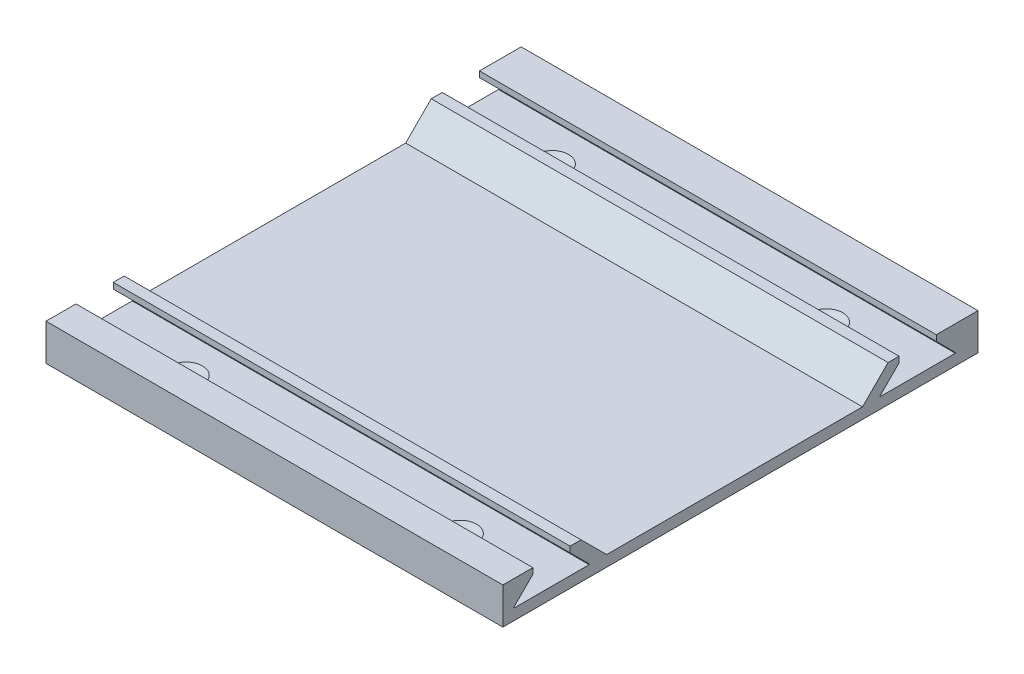
ISO-10303-21;
HEADER;
FILE_DESCRIPTION(('STEP AP214'),'2;1');
FILE_NAME('part.step','',(''),(''),'','','');
FILE_SCHEMA(('AUTOMOTIVE_DESIGN { 1 0 10303 214 1 1 1 1 }'));
ENDSEC;
DATA;
#1=APPLICATION_CONTEXT('core data for automotive mechanical design processes');
#2=APPLICATION_PROTOCOL_DEFINITION('international standard','automotive_design',2000,#1);
#3=PRODUCT_CONTEXT('',#1,'mechanical');
#4=PRODUCT('Part','Part','',(#3));
#5=PRODUCT_RELATED_PRODUCT_CATEGORY('part','',(#4));
#6=PRODUCT_DEFINITION_FORMATION('','',#4);
#7=PRODUCT_DEFINITION_CONTEXT('part definition',#1,'design');
#8=PRODUCT_DEFINITION('design','',#6,#7);
#9=PRODUCT_DEFINITION_SHAPE('','',#8);
#10=(LENGTH_UNIT() NAMED_UNIT(*) SI_UNIT(.MILLI.,.METRE.));
#11=(NAMED_UNIT(*) PLANE_ANGLE_UNIT() SI_UNIT($,.RADIAN.));
#12=(NAMED_UNIT(*) SI_UNIT($,.STERADIAN.) SOLID_ANGLE_UNIT());
#13=UNCERTAINTY_MEASURE_WITH_UNIT(LENGTH_MEASURE(1.E-05),#10,'distance_accuracy_value','');
#14=(GEOMETRIC_REPRESENTATION_CONTEXT(3) GLOBAL_UNCERTAINTY_ASSIGNED_CONTEXT((#13)) GLOBAL_UNIT_ASSIGNED_CONTEXT((#10,
#11,#12)) REPRESENTATION_CONTEXT('',''));
#15=CARTESIAN_POINT('',(0.,0.,0.));
#16=DIRECTION('',(0.,0.,1.));
#17=DIRECTION('',(1.,0.,0.));
#18=AXIS2_PLACEMENT_3D('',#15,#16,#17);
#19=CARTESIAN_POINT('',(0.,10.,0.));
#20=DIRECTION('',(0.,-1.,0.));
#21=DIRECTION('',(0.,0.,-1.));
#22=AXIS2_PLACEMENT_3D('',#19,#20,#21);
#23=PLANE('',#22);
#24=DIRECTION('',(-1.,0.,0.));
#25=VECTOR('',#24,1.);
#26=CARTESIAN_POINT('',(125.,10.,-21.4));
#27=LINE('',#26,#25);
#28=CARTESIAN_POINT('',(125.,10.,-21.4));
#29=VERTEX_POINT('',#28);
#30=CARTESIAN_POINT('',(0.,10.,-21.4));
#31=VERTEX_POINT('',#30);
#32=EDGE_CURVE('E230',#29,#31,#27,.T.);
#33=ORIENTED_EDGE('',*,*,#32,.T.);
#34=DIRECTION('',(0.,0.,1.));
#35=VECTOR('',#34,1.);
#36=CARTESIAN_POINT('',(0.,10.,0.));
#37=LINE('',#36,#35);
#38=CARTESIAN_POINT('',(0.,10.,-18.4));
#39=VERTEX_POINT('',#38);
#40=EDGE_CURVE('E353',#31,#39,#37,.T.);
#41=ORIENTED_EDGE('',*,*,#40,.T.);
#42=DIRECTION('',(1.,0.,0.));
#43=VECTOR('',#42,1.);
#44=CARTESIAN_POINT('',(-21.7568380055559,10.,-18.4));
#45=LINE('',#44,#43);
#46=CARTESIAN_POINT('',(125.,10.,-18.4));
#47=VERTEX_POINT('',#46);
#48=EDGE_CURVE('E249',#39,#47,#45,.T.);
#49=ORIENTED_EDGE('',*,*,#48,.T.);
#50=DIRECTION('',(0.,0.,-1.));
#51=VECTOR('',#50,1.);
#52=CARTESIAN_POINT('',(125.,10.,0.));
#53=LINE('',#52,#51);
#54=EDGE_CURVE('E360',#47,#29,#53,.T.);
#55=ORIENTED_EDGE('',*,*,#54,.T.);
#56=EDGE_LOOP('',(#33,#41,#49,#55));
#57=FACE_BOUND('',#56,.T.);
#58=ADVANCED_FACE('F35',(#57),#23,.F.);
#59=CARTESIAN_POINT('',(0.,10.,-108.4));
#60=VERTEX_POINT('',#59);
#61=CARTESIAN_POINT('',(0.,10.,-105.4));
#62=VERTEX_POINT('',#61);
#63=EDGE_CURVE('E352',#60,#62,#37,.T.);
#64=ORIENTED_EDGE('',*,*,#63,.T.);
#65=DIRECTION('',(-1.,0.,0.));
#66=VECTOR('',#65,1.);
#67=CARTESIAN_POINT('',(125.,10.,-105.4));
#68=LINE('',#67,#66);
#69=CARTESIAN_POINT('',(125.,10.,-105.4));
#70=VERTEX_POINT('',#69);
#71=EDGE_CURVE('E227',#70,#62,#68,.T.);
#72=ORIENTED_EDGE('',*,*,#71,.F.);
#73=CARTESIAN_POINT('',(125.,10.,-108.4));
#74=VERTEX_POINT('',#73);
#75=EDGE_CURVE('E217',#70,#74,#53,.T.);
#76=ORIENTED_EDGE('',*,*,#75,.T.);
#77=DIRECTION('',(1.,0.,0.));
#78=VECTOR('',#77,1.);
#79=CARTESIAN_POINT('',(-21.7568380055559,10.,-108.4));
#80=LINE('',#79,#78);
#81=EDGE_CURVE('E330',#60,#74,#80,.T.);
#82=ORIENTED_EDGE('',*,*,#81,.F.);
#83=EDGE_LOOP('',(#64,#72,#76,#82));
#84=FACE_BOUND('',#83,.T.);
#85=ADVANCED_FACE('F454',(#84),#23,.F.);
#86=CARTESIAN_POINT('',(0.,10.,-130.));
#87=VERTEX_POINT('',#86);
#88=CARTESIAN_POINT('',(0.,10.,-118.6));
#89=VERTEX_POINT('',#88);
#90=EDGE_CURVE('E348',#87,#89,#37,.T.);
#91=ORIENTED_EDGE('',*,*,#90,.T.);
#92=DIRECTION('',(1.,0.,0.));
#93=VECTOR('',#92,1.);
#94=CARTESIAN_POINT('',(-21.7568380055559,10.,-118.6));
#95=LINE('',#94,#93);
#96=CARTESIAN_POINT('',(125.,10.,-118.6));
#97=VERTEX_POINT('',#96);
#98=EDGE_CURVE('E301',#89,#97,#95,.T.);
#99=ORIENTED_EDGE('',*,*,#98,.T.);
#100=CARTESIAN_POINT('',(125.,10.,-130.));
#101=VERTEX_POINT('',#100);
#102=EDGE_CURVE('E355',#97,#101,#53,.T.);
#103=ORIENTED_EDGE('',*,*,#102,.T.);
#104=DIRECTION('',(-1.,0.,0.));
#105=VECTOR('',#104,1.);
#106=CARTESIAN_POINT('',(0.,10.,-130.));
#107=LINE('',#106,#105);
#108=EDGE_CURVE('E359',#101,#87,#107,.T.);
#109=ORIENTED_EDGE('',*,*,#108,.T.);
#110=EDGE_LOOP('',(#91,#99,#103,#109));
#111=FACE_BOUND('',#110,.T.);
#112=ADVANCED_FACE('F467',(#111),#23,.F.);
#113=CARTESIAN_POINT('',(0.,10.,0.));
#114=DIRECTION('',(1.,0.,0.));
#115=DIRECTION('',(0.,0.,-1.));
#116=AXIS2_PLACEMENT_3D('',#113,#114,#115);
#117=PLANE('',#116);
#118=DIRECTION('',(0.,0.,1.));
#119=VECTOR('',#118,1.);
#120=CARTESIAN_POINT('',(0.,3.,0.));
#121=LINE('',#120,#119);
#122=CARTESIAN_POINT('',(0.,3.,-98.4000000000001));
#123=VERTEX_POINT('',#122);
#124=CARTESIAN_POINT('',(0.,3.,-28.3999999999999));
#125=VERTEX_POINT('',#124);
#126=EDGE_CURVE('E221',#123,#125,#121,.T.);
#127=ORIENTED_EDGE('',*,*,#126,.F.);
#128=DIRECTION('',(0.,-0.707106781186552,0.707106781186543));
#129=VECTOR('',#128,1.);
#130=CARTESIAN_POINT('',(0.,-47.7000000000001,-47.7000000000007));
#131=LINE('',#130,#129);
#132=EDGE_CURVE('E204',#62,#123,#131,.T.);
#133=ORIENTED_EDGE('',*,*,#132,.F.);
#134=ORIENTED_EDGE('',*,*,#63,.F.);
#135=DIRECTION('',(0.,1.,0.));
#136=VECTOR('',#135,1.);
#137=CARTESIAN_POINT('',(0.,10.,-108.4));
#138=LINE('',#137,#136);
#139=CARTESIAN_POINT('',(0.,8.40000000000001,-108.4));
#140=VERTEX_POINT('',#139);
#141=EDGE_CURVE('E263',#140,#60,#138,.T.);
#142=ORIENTED_EDGE('',*,*,#141,.F.);
#143=DIRECTION('',(0.,0.707106781186547,-0.707106781186548));
#144=VECTOR('',#143,1.);
#145=CARTESIAN_POINT('',(0.,8.40000000000001,-108.4));
#146=LINE('',#145,#144);
#147=CARTESIAN_POINT('',(0.,3.20000000000001,-103.2));
#148=VERTEX_POINT('',#147);
#149=EDGE_CURVE('E298',#148,#140,#146,.T.);
#150=ORIENTED_EDGE('',*,*,#149,.F.);
#151=DIRECTION('',(0.,1.,0.));
#152=VECTOR('',#151,1.);
#153=CARTESIAN_POINT('',(0.,3.00000000000001,-103.2));
#154=LINE('',#153,#152);
#155=CARTESIAN_POINT('',(0.,3.00000000000001,-103.2));
#156=VERTEX_POINT('',#155);
#157=EDGE_CURVE('E300',#156,#148,#154,.T.);
#158=ORIENTED_EDGE('',*,*,#157,.F.);
#159=DIRECTION('',(0.,0.,1.));
#160=VECTOR('',#159,1.);
#161=CARTESIAN_POINT('',(0.,3.00000000000001,-123.8));
#162=LINE('',#161,#160);
#163=CARTESIAN_POINT('',(0.,3.00000000000001,-123.8));
#164=VERTEX_POINT('',#163);
#165=EDGE_CURVE('E303',#164,#156,#162,.T.);
#166=ORIENTED_EDGE('',*,*,#165,.F.);
#167=DIRECTION('',(0.,-1.,0.));
#168=VECTOR('',#167,1.);
#169=CARTESIAN_POINT('',(0.,3.00000000000001,-123.8));
#170=LINE('',#169,#168);
#171=CARTESIAN_POINT('',(0.,3.20000000000001,-123.8));
#172=VERTEX_POINT('',#171);
#173=EDGE_CURVE('E305',#172,#164,#170,.T.);
#174=ORIENTED_EDGE('',*,*,#173,.F.);
#175=DIRECTION('',(0.,-0.707106781186547,-0.707106781186548));
#176=VECTOR('',#175,1.);
#177=CARTESIAN_POINT('',(0.,8.40000000000001,-118.6));
#178=LINE('',#177,#176);
#179=CARTESIAN_POINT('',(0.,8.40000000000001,-118.6));
#180=VERTEX_POINT('',#179);
#181=EDGE_CURVE('E307',#180,#172,#178,.T.);
#182=ORIENTED_EDGE('',*,*,#181,.F.);
#183=DIRECTION('',(0.,-1.,0.));
#184=VECTOR('',#183,1.);
#185=CARTESIAN_POINT('',(0.,10.,-118.6));
#186=LINE('',#185,#184);
#187=EDGE_CURVE('E309',#89,#180,#186,.T.);
#188=ORIENTED_EDGE('',*,*,#187,.F.);
#189=ORIENTED_EDGE('',*,*,#90,.F.);
#190=DIRECTION('',(0.,-1.,0.));
#191=VECTOR('',#190,1.);
#192=CARTESIAN_POINT('',(0.,10.,-130.));
#193=LINE('',#192,#191);
#194=CARTESIAN_POINT('',(0.,0.,-130.));
#195=VERTEX_POINT('',#194);
#196=EDGE_CURVE('E362',#87,#195,#193,.T.);
#197=ORIENTED_EDGE('',*,*,#196,.T.);
#198=DIRECTION('',(0.,0.,1.));
#199=VECTOR('',#198,1.);
#200=CARTESIAN_POINT('',(0.,0.,0.));
#201=LINE('',#200,#199);
#202=CARTESIAN_POINT('',(0.,0.,0.));
#203=VERTEX_POINT('',#202);
#204=EDGE_CURVE('E297',#195,#203,#201,.T.);
#205=ORIENTED_EDGE('',*,*,#204,.T.);
#206=DIRECTION('',(0.,-1.,0.));
#207=VECTOR('',#206,1.);
#208=CARTESIAN_POINT('',(0.,10.,0.));
#209=LINE('',#208,#207);
#210=CARTESIAN_POINT('',(0.,10.,0.));
#211=VERTEX_POINT('',#210);
#212=EDGE_CURVE('E380',#211,#203,#209,.T.);
#213=ORIENTED_EDGE('',*,*,#212,.F.);
#214=CARTESIAN_POINT('',(0.,10.,-8.20000000000001));
#215=VERTEX_POINT('',#214);
#216=EDGE_CURVE('E371',#215,#211,#37,.T.);
#217=ORIENTED_EDGE('',*,*,#216,.F.);
#218=DIRECTION('',(0.,1.,0.));
#219=VECTOR('',#218,1.);
#220=CARTESIAN_POINT('',(0.,10.,-8.20000000000001));
#221=LINE('',#220,#219);
#222=CARTESIAN_POINT('',(0.,8.4,-8.20000000000002));
#223=VERTEX_POINT('',#222);
#224=EDGE_CURVE('E59',#223,#215,#221,.T.);
#225=ORIENTED_EDGE('',*,*,#224,.F.);
#226=DIRECTION('',(0.,0.707106781186546,-0.707106781186549));
#227=VECTOR('',#226,1.);
#228=CARTESIAN_POINT('',(0.,8.4,-8.20000000000002));
#229=LINE('',#228,#227);
#230=CARTESIAN_POINT('',(0.,3.2,-3.));
#231=VERTEX_POINT('',#230);
#232=EDGE_CURVE('E246',#231,#223,#229,.T.);
#233=ORIENTED_EDGE('',*,*,#232,.F.);
#234=DIRECTION('',(0.,1.,0.));
#235=VECTOR('',#234,1.);
#236=CARTESIAN_POINT('',(0.,3.,-3.));
#237=LINE('',#236,#235);
#238=CARTESIAN_POINT('',(0.,3.,-3.));
#239=VERTEX_POINT('',#238);
#240=EDGE_CURVE('E248',#239,#231,#237,.T.);
#241=ORIENTED_EDGE('',*,*,#240,.F.);
#242=DIRECTION('',(0.,0.,1.));
#243=VECTOR('',#242,1.);
#244=CARTESIAN_POINT('',(0.,3.,-3.));
#245=LINE('',#244,#243);
#246=CARTESIAN_POINT('',(0.,3.,-23.6));
#247=VERTEX_POINT('',#246);
#248=EDGE_CURVE('E251',#247,#239,#245,.T.);
#249=ORIENTED_EDGE('',*,*,#248,.F.);
#250=DIRECTION('',(0.,-1.,0.));
#251=VECTOR('',#250,1.);
#252=CARTESIAN_POINT('',(0.,3.,-23.6));
#253=LINE('',#252,#251);
#254=CARTESIAN_POINT('',(0.,3.2,-23.6));
#255=VERTEX_POINT('',#254);
#256=EDGE_CURVE('E253',#255,#247,#253,.T.);
#257=ORIENTED_EDGE('',*,*,#256,.F.);
#258=DIRECTION('',(0.,-0.707106781186547,-0.707106781186549));
#259=VECTOR('',#258,1.);
#260=CARTESIAN_POINT('',(0.,8.4,-18.4));
#261=LINE('',#260,#259);
#262=CARTESIAN_POINT('',(0.,8.4,-18.4));
#263=VERTEX_POINT('',#262);
#264=EDGE_CURVE('E255',#263,#255,#261,.T.);
#265=ORIENTED_EDGE('',*,*,#264,.F.);
#266=DIRECTION('',(0.,-1.,0.));
#267=VECTOR('',#266,1.);
#268=CARTESIAN_POINT('',(0.,10.,-18.4));
#269=LINE('',#268,#267);
#270=EDGE_CURVE('E257',#39,#263,#269,.T.);
#271=ORIENTED_EDGE('',*,*,#270,.F.);
#272=ORIENTED_EDGE('',*,*,#40,.F.);
#273=DIRECTION('',(0.,-0.707106781186551,-0.707106781186544));
#274=VECTOR('',#273,1.);
#275=CARTESIAN_POINT('',(0.,15.6999999999999,-15.7000000000001));
#276=LINE('',#275,#274);
#277=EDGE_CURVE('E218',#31,#125,#276,.T.);
#278=ORIENTED_EDGE('',*,*,#277,.T.);
#279=EDGE_LOOP('',(#127,#133,#134,#142,#150,#158,#166,#174,#182,#188,#189,#197,#205,#213,#217,
#225,#233,#241,#249,#257,#265,#271,#272,#278));
#280=FACE_BOUND('',#279,.T.);
#281=ADVANCED_FACE('F432',(#280),#117,.F.);
#282=CARTESIAN_POINT('',(0.,10.,0.));
#283=DIRECTION('',(0.,0.,-1.));
#284=DIRECTION('',(-1.,0.,0.));
#285=AXIS2_PLACEMENT_3D('',#282,#283,#284);
#286=PLANE('',#285);
#287=DIRECTION('',(1.,0.,0.));
#288=VECTOR('',#287,1.);
#289=CARTESIAN_POINT('',(0.,0.,0.));
#290=LINE('',#289,#288);
#291=CARTESIAN_POINT('',(125.,0.,0.));
#292=VERTEX_POINT('',#291);
#293=EDGE_CURVE('E365',#203,#292,#290,.T.);
#294=ORIENTED_EDGE('',*,*,#293,.T.);
#295=DIRECTION('',(0.,-1.,0.));
#296=VECTOR('',#295,1.);
#297=CARTESIAN_POINT('',(125.,10.,0.));
#298=LINE('',#297,#296);
#299=CARTESIAN_POINT('',(125.,10.,0.));
#300=VERTEX_POINT('',#299);
#301=EDGE_CURVE('E377',#300,#292,#298,.T.);
#302=ORIENTED_EDGE('',*,*,#301,.F.);
#303=DIRECTION('',(1.,0.,0.));
#304=VECTOR('',#303,1.);
#305=CARTESIAN_POINT('',(0.,10.,0.));
#306=LINE('',#305,#304);
#307=EDGE_CURVE('E351',#211,#300,#306,.T.);
#308=ORIENTED_EDGE('',*,*,#307,.F.);
#309=ORIENTED_EDGE('',*,*,#212,.T.);
#310=EDGE_LOOP('',(#294,#302,#308,#309));
#311=FACE_BOUND('',#310,.T.);
#312=ADVANCED_FACE('F448',(#311),#286,.F.);
#313=CARTESIAN_POINT('',(125.,10.,0.));
#314=DIRECTION('',(-1.,0.,0.));
#315=DIRECTION('',(0.,0.,1.));
#316=AXIS2_PLACEMENT_3D('',#313,#314,#315);
#317=PLANE('',#316);
#318=ORIENTED_EDGE('',*,*,#75,.F.);
#319=DIRECTION('',(0.,-0.707106781186552,0.707106781186543));
#320=VECTOR('',#319,1.);
#321=CARTESIAN_POINT('',(125.,-47.7000000000001,-47.7000000000007));
#322=LINE('',#321,#320);
#323=CARTESIAN_POINT('',(125.,3.,-98.4000000000001));
#324=VERTEX_POINT('',#323);
#325=EDGE_CURVE('E201',#70,#324,#322,.T.);
#326=ORIENTED_EDGE('',*,*,#325,.T.);
#327=DIRECTION('',(0.,0.,1.));
#328=VECTOR('',#327,1.);
#329=CARTESIAN_POINT('',(125.,3.,0.));
#330=LINE('',#329,#328);
#331=CARTESIAN_POINT('',(125.,3.,-28.3999999999999));
#332=VERTEX_POINT('',#331);
#333=EDGE_CURVE('E209',#324,#332,#330,.T.);
#334=ORIENTED_EDGE('',*,*,#333,.T.);
#335=DIRECTION('',(0.,-0.707106781186551,-0.707106781186544));
#336=VECTOR('',#335,1.);
#337=CARTESIAN_POINT('',(125.,15.6999999999999,-15.7000000000001));
#338=LINE('',#337,#336);
#339=EDGE_CURVE('E206',#29,#332,#338,.T.);
#340=ORIENTED_EDGE('',*,*,#339,.F.);
#341=ORIENTED_EDGE('',*,*,#54,.F.);
#342=DIRECTION('',(0.,1.,0.));
#343=VECTOR('',#342,1.);
#344=CARTESIAN_POINT('',(125.,10.,-18.4));
#345=LINE('',#344,#343);
#346=CARTESIAN_POINT('',(125.,8.4,-18.4));
#347=VERTEX_POINT('',#346);
#348=EDGE_CURVE('E278',#347,#47,#345,.T.);
#349=ORIENTED_EDGE('',*,*,#348,.F.);
#350=DIRECTION('',(0.,0.707106781186546,0.707106781186549));
#351=VECTOR('',#350,1.);
#352=CARTESIAN_POINT('',(125.,8.4,-18.4));
#353=LINE('',#352,#351);
#354=CARTESIAN_POINT('',(125.,3.2,-23.6));
#355=VERTEX_POINT('',#354);
#356=EDGE_CURVE('E275',#355,#347,#353,.T.);
#357=ORIENTED_EDGE('',*,*,#356,.F.);
#358=DIRECTION('',(0.,1.,0.));
#359=VECTOR('',#358,1.);
#360=CARTESIAN_POINT('',(125.,3.,-23.6));
#361=LINE('',#360,#359);
#362=CARTESIAN_POINT('',(125.,3.,-23.6));
#363=VERTEX_POINT('',#362);
#364=EDGE_CURVE('E272',#363,#355,#361,.T.);
#365=ORIENTED_EDGE('',*,*,#364,.F.);
#366=DIRECTION('',(0.,0.,-1.));
#367=VECTOR('',#366,1.);
#368=CARTESIAN_POINT('',(125.,3.,-3.));
#369=LINE('',#368,#367);
#370=CARTESIAN_POINT('',(125.,3.,-3.));
#371=VERTEX_POINT('',#370);
#372=EDGE_CURVE('E269',#371,#363,#369,.T.);
#373=ORIENTED_EDGE('',*,*,#372,.F.);
#374=DIRECTION('',(0.,-1.,0.));
#375=VECTOR('',#374,1.);
#376=CARTESIAN_POINT('',(125.,3.,-3.));
#377=LINE('',#376,#375);
#378=CARTESIAN_POINT('',(125.,3.2,-3.));
#379=VERTEX_POINT('',#378);
#380=EDGE_CURVE('E266',#379,#371,#377,.T.);
#381=ORIENTED_EDGE('',*,*,#380,.F.);
#382=DIRECTION('',(0.,-0.707106781186546,0.707106781186549));
#383=VECTOR('',#382,1.);
#384=CARTESIAN_POINT('',(125.,8.4,-8.20000000000002));
#385=LINE('',#384,#383);
#386=CARTESIAN_POINT('',(125.,8.4,-8.20000000000002));
#387=VERTEX_POINT('',#386);
#388=EDGE_CURVE('E262',#387,#379,#385,.T.);
#389=ORIENTED_EDGE('',*,*,#388,.F.);
#390=DIRECTION('',(0.,-1.,0.));
#391=VECTOR('',#390,1.);
#392=CARTESIAN_POINT('',(125.,10.,-8.20000000000001));
#393=LINE('',#392,#391);
#394=CARTESIAN_POINT('',(125.,10.,-8.20000000000001));
#395=VERTEX_POINT('',#394);
#396=EDGE_CURVE('E259',#395,#387,#393,.T.);
#397=ORIENTED_EDGE('',*,*,#396,.F.);
#398=EDGE_CURVE('E356',#300,#395,#53,.T.);
#399=ORIENTED_EDGE('',*,*,#398,.F.);
#400=ORIENTED_EDGE('',*,*,#301,.T.);
#401=DIRECTION('',(0.,0.,-1.));
#402=VECTOR('',#401,1.);
#403=CARTESIAN_POINT('',(125.,0.,0.));
#404=LINE('',#403,#402);
#405=CARTESIAN_POINT('',(125.,0.,-130.));
#406=VERTEX_POINT('',#405);
#407=EDGE_CURVE('E367',#292,#406,#404,.T.);
#408=ORIENTED_EDGE('',*,*,#407,.T.);
#409=DIRECTION('',(0.,-1.,0.));
#410=VECTOR('',#409,1.);
#411=CARTESIAN_POINT('',(125.,10.,-130.));
#412=LINE('',#411,#410);
#413=EDGE_CURVE('E374',#101,#406,#412,.T.);
#414=ORIENTED_EDGE('',*,*,#413,.F.);
#415=ORIENTED_EDGE('',*,*,#102,.F.);
#416=DIRECTION('',(0.,1.,0.));
#417=VECTOR('',#416,1.);
#418=CARTESIAN_POINT('',(125.,10.,-118.6));
#419=LINE('',#418,#417);
#420=CARTESIAN_POINT('',(125.,8.40000000000001,-118.6));
#421=VERTEX_POINT('',#420);
#422=EDGE_CURVE('E328',#421,#97,#419,.T.);
#423=ORIENTED_EDGE('',*,*,#422,.F.);
#424=DIRECTION('',(0.,0.707106781186547,0.707106781186548));
#425=VECTOR('',#424,1.);
#426=CARTESIAN_POINT('',(125.,8.40000000000001,-118.6));
#427=LINE('',#426,#425);
#428=CARTESIAN_POINT('',(125.,3.20000000000001,-123.8));
#429=VERTEX_POINT('',#428);
#430=EDGE_CURVE('E325',#429,#421,#427,.T.);
#431=ORIENTED_EDGE('',*,*,#430,.F.);
#432=DIRECTION('',(0.,1.,0.));
#433=VECTOR('',#432,1.);
#434=CARTESIAN_POINT('',(125.,3.00000000000001,-123.8));
#435=LINE('',#434,#433);
#436=CARTESIAN_POINT('',(125.,3.00000000000001,-123.8));
#437=VERTEX_POINT('',#436);
#438=EDGE_CURVE('E322',#437,#429,#435,.T.);
#439=ORIENTED_EDGE('',*,*,#438,.F.);
#440=DIRECTION('',(0.,0.,-1.));
#441=VECTOR('',#440,1.);
#442=CARTESIAN_POINT('',(125.,3.00000000000001,-123.8));
#443=LINE('',#442,#441);
#444=CARTESIAN_POINT('',(125.,3.00000000000001,-103.2));
#445=VERTEX_POINT('',#444);
#446=EDGE_CURVE('E319',#445,#437,#443,.T.);
#447=ORIENTED_EDGE('',*,*,#446,.F.);
#448=DIRECTION('',(0.,-1.,0.));
#449=VECTOR('',#448,1.);
#450=CARTESIAN_POINT('',(125.,3.00000000000001,-103.2));
#451=LINE('',#450,#449);
#452=CARTESIAN_POINT('',(125.,3.20000000000001,-103.2));
#453=VERTEX_POINT('',#452);
#454=EDGE_CURVE('E316',#453,#445,#451,.T.);
#455=ORIENTED_EDGE('',*,*,#454,.F.);
#456=DIRECTION('',(0.,-0.707106781186547,0.707106781186548));
#457=VECTOR('',#456,1.);
#458=CARTESIAN_POINT('',(125.,8.40000000000001,-108.4));
#459=LINE('',#458,#457);
#460=CARTESIAN_POINT('',(125.,8.40000000000001,-108.4));
#461=VERTEX_POINT('',#460);
#462=EDGE_CURVE('E313',#461,#453,#459,.T.);
#463=ORIENTED_EDGE('',*,*,#462,.F.);
#464=DIRECTION('',(0.,-1.,0.));
#465=VECTOR('',#464,1.);
#466=CARTESIAN_POINT('',(125.,10.,-108.4));
#467=LINE('',#466,#465);
#468=EDGE_CURVE('E245',#74,#461,#467,.T.);
#469=ORIENTED_EDGE('',*,*,#468,.F.);
#470=EDGE_LOOP('',(#318,#326,#334,#340,#341,#349,#357,#365,#373,#381,#389,#397,#399,#400,#408,
#414,#415,#423,#431,#439,#447,#455,#463,#469));
#471=FACE_BOUND('',#470,.T.);
#472=ADVANCED_FACE('F215',(#471),#317,.F.);
#473=CARTESIAN_POINT('',(0.,10.,-130.));
#474=DIRECTION('',(0.,0.,1.));
#475=DIRECTION('',(1.,0.,0.));
#476=AXIS2_PLACEMENT_3D('',#473,#474,#475);
#477=PLANE('',#476);
#478=DIRECTION('',(-1.,0.,0.));
#479=VECTOR('',#478,1.);
#480=CARTESIAN_POINT('',(0.,0.,-130.));
#481=LINE('',#480,#479);
#482=EDGE_CURVE('E369',#406,#195,#481,.T.);
#483=ORIENTED_EDGE('',*,*,#482,.T.);
#484=ORIENTED_EDGE('',*,*,#196,.F.);
#485=ORIENTED_EDGE('',*,*,#108,.F.);
#486=ORIENTED_EDGE('',*,*,#413,.T.);
#487=EDGE_LOOP('',(#483,#484,#485,#486));
#488=FACE_BOUND('',#487,.T.);
#489=ADVANCED_FACE('F439',(#488),#477,.F.);
#490=ORIENTED_EDGE('',*,*,#398,.T.);
#491=DIRECTION('',(1.,0.,0.));
#492=VECTOR('',#491,1.);
#493=CARTESIAN_POINT('',(-21.7568380055559,10.,-8.20000000000001));
#494=LINE('',#493,#492);
#495=EDGE_CURVE('E280',#215,#395,#494,.T.);
#496=ORIENTED_EDGE('',*,*,#495,.F.);
#497=ORIENTED_EDGE('',*,*,#216,.T.);
#498=ORIENTED_EDGE('',*,*,#307,.T.);
#499=EDGE_LOOP('',(#490,#496,#497,#498));
#500=FACE_BOUND('',#499,.T.);
#501=ADVANCED_FACE('F424',(#500),#23,.F.);
#502=CARTESIAN_POINT('',(0.,0.,0.));
#503=DIRECTION('',(0.,-1.,0.));
#504=DIRECTION('',(0.,0.,-1.));
#505=AXIS2_PLACEMENT_3D('',#502,#503,#504);
#506=PLANE('',#505);
#507=CARTESIAN_POINT('',(25.,0.,-13.3));
#508=DIRECTION('',(0.,-1.,0.));
#509=DIRECTION('',(0.,0.,-1.));
#510=AXIS2_PLACEMENT_3D('',#507,#508,#509);
#511=CIRCLE('',#510,2.5);
#512=CARTESIAN_POINT('',(25.,0.,-15.8));
#513=VERTEX_POINT('',#512);
#514=EDGE_CURVE('E237',#513,#513,#511,.F.);
#515=ORIENTED_EDGE('',*,*,#514,.T.);
#516=EDGE_LOOP('',(#515));
#517=FACE_BOUND('',#516,.T.);
#518=CARTESIAN_POINT('',(100.,0.,-113.5));
#519=DIRECTION('',(0.,-1.,0.));
#520=DIRECTION('',(0.,0.,-1.));
#521=AXIS2_PLACEMENT_3D('',#518,#519,#520);
#522=CIRCLE('',#521,2.5);
#523=CARTESIAN_POINT('',(100.,0.,-116.));
#524=VERTEX_POINT('',#523);
#525=EDGE_CURVE('E236',#524,#524,#522,.F.);
#526=ORIENTED_EDGE('',*,*,#525,.T.);
#527=EDGE_LOOP('',(#526));
#528=FACE_BOUND('',#527,.T.);
#529=CARTESIAN_POINT('',(25.,0.,-113.5));
#530=DIRECTION('',(0.,-1.,0.));
#531=DIRECTION('',(0.,0.,-1.));
#532=AXIS2_PLACEMENT_3D('',#529,#530,#531);
#533=CIRCLE('',#532,2.5);
#534=CARTESIAN_POINT('',(25.,0.,-116.));
#535=VERTEX_POINT('',#534);
#536=EDGE_CURVE('E229',#535,#535,#533,.F.);
#537=ORIENTED_EDGE('',*,*,#536,.T.);
#538=EDGE_LOOP('',(#537));
#539=FACE_BOUND('',#538,.T.);
#540=CARTESIAN_POINT('',(100.,0.,-13.3));
#541=DIRECTION('',(0.,-1.,0.));
#542=DIRECTION('',(0.,0.,-1.));
#543=AXIS2_PLACEMENT_3D('',#540,#541,#542);
#544=CIRCLE('',#543,2.5);
#545=CARTESIAN_POINT('',(100.,0.,-15.8));
#546=VERTEX_POINT('',#545);
#547=EDGE_CURVE('E240',#546,#546,#544,.F.);
#548=ORIENTED_EDGE('',*,*,#547,.T.);
#549=EDGE_LOOP('',(#548));
#550=FACE_BOUND('',#549,.T.);
#551=ORIENTED_EDGE('',*,*,#204,.F.);
#552=ORIENTED_EDGE('',*,*,#482,.F.);
#553=ORIENTED_EDGE('',*,*,#407,.F.);
#554=ORIENTED_EDGE('',*,*,#293,.F.);
#555=EDGE_LOOP('',(#551,#552,#553,#554));
#556=FACE_BOUND('',#555,.T.);
#557=ADVANCED_FACE('F420',(#517,#528,#539,#550,#556),#506,.T.);
#558=CARTESIAN_POINT('',(-21.7568380055559,10.,-118.6));
#559=DIRECTION('',(0.,0.,-1.));
#560=DIRECTION('',(-1.,0.,0.));
#561=AXIS2_PLACEMENT_3D('',#558,#559,#560);
#562=PLANE('',#561);
#563=ORIENTED_EDGE('',*,*,#187,.T.);
#564=DIRECTION('',(1.,0.,0.));
#565=VECTOR('',#564,1.);
#566=CARTESIAN_POINT('',(-21.7568380055559,8.40000000000001,-118.6));
#567=LINE('',#566,#565);
#568=EDGE_CURVE('E333',#180,#421,#567,.T.);
#569=ORIENTED_EDGE('',*,*,#568,.T.);
#570=ORIENTED_EDGE('',*,*,#422,.T.);
#571=ORIENTED_EDGE('',*,*,#98,.F.);
#572=EDGE_LOOP('',(#563,#569,#570,#571));
#573=FACE_BOUND('',#572,.T.);
#574=ADVANCED_FACE('F423',(#573),#562,.F.);
#575=CARTESIAN_POINT('',(-21.7568380055559,8.40000000000001,-118.6));
#576=DIRECTION('',(0.,0.707106781186548,-0.707106781186547));
#577=DIRECTION('',(0.,0.707106781186547,0.707106781186548));
#578=AXIS2_PLACEMENT_3D('',#575,#576,#577);
#579=PLANE('',#578);
#580=ORIENTED_EDGE('',*,*,#181,.T.);
#581=DIRECTION('',(1.,0.,0.));
#582=VECTOR('',#581,1.);
#583=CARTESIAN_POINT('',(-21.7568380055559,3.20000000000001,-123.8));
#584=LINE('',#583,#582);
#585=EDGE_CURVE('E335',#172,#429,#584,.T.);
#586=ORIENTED_EDGE('',*,*,#585,.T.);
#587=ORIENTED_EDGE('',*,*,#430,.T.);
#588=ORIENTED_EDGE('',*,*,#568,.F.);
#589=EDGE_LOOP('',(#580,#586,#587,#588));
#590=FACE_BOUND('',#589,.T.);
#591=ADVANCED_FACE('F475',(#590),#579,.F.);
#592=CARTESIAN_POINT('',(-21.7568380055559,3.00000000000001,-123.8));
#593=DIRECTION('',(0.,0.,-1.));
#594=DIRECTION('',(-1.,0.,0.));
#595=AXIS2_PLACEMENT_3D('',#592,#593,#594);
#596=PLANE('',#595);
#597=ORIENTED_EDGE('',*,*,#173,.T.);
#598=DIRECTION('',(1.,0.,0.));
#599=VECTOR('',#598,1.);
#600=CARTESIAN_POINT('',(-21.7568380055559,3.00000000000001,-123.8));
#601=LINE('',#600,#599);
#602=EDGE_CURVE('E337',#164,#437,#601,.T.);
#603=ORIENTED_EDGE('',*,*,#602,.T.);
#604=ORIENTED_EDGE('',*,*,#438,.T.);
#605=ORIENTED_EDGE('',*,*,#585,.F.);
#606=EDGE_LOOP('',(#597,#603,#604,#605));
#607=FACE_BOUND('',#606,.T.);
#608=ADVANCED_FACE('F477',(#607),#596,.F.);
#609=CARTESIAN_POINT('',(-21.7568380055559,3.00000000000001,-123.8));
#610=DIRECTION('',(0.,-1.,0.));
#611=DIRECTION('',(0.,0.,-1.));
#612=AXIS2_PLACEMENT_3D('',#609,#610,#611);
#613=PLANE('',#612);
#614=CARTESIAN_POINT('',(25.,3.00000000000001,-113.5));
#615=DIRECTION('',(0.,-1.,0.));
#616=DIRECTION('',(0.,0.,-1.));
#617=AXIS2_PLACEMENT_3D('',#614,#615,#616);
#618=CIRCLE('',#617,4.5);
#619=CARTESIAN_POINT('',(25.,3.00000000000001,-118.));
#620=VERTEX_POINT('',#619);
#621=EDGE_CURVE('E389',#620,#620,#618,.T.);
#622=ORIENTED_EDGE('',*,*,#621,.T.);
#623=EDGE_LOOP('',(#622));
#624=FACE_BOUND('',#623,.T.);
#625=CARTESIAN_POINT('',(100.,3.00000000000001,-113.5));
#626=DIRECTION('',(0.,-1.,0.));
#627=DIRECTION('',(0.,0.,-1.));
#628=AXIS2_PLACEMENT_3D('',#625,#626,#627);
#629=CIRCLE('',#628,4.5);
#630=CARTESIAN_POINT('',(100.,3.00000000000001,-118.));
#631=VERTEX_POINT('',#630);
#632=EDGE_CURVE('E386',#631,#631,#629,.T.);
#633=ORIENTED_EDGE('',*,*,#632,.T.);
#634=EDGE_LOOP('',(#633));
#635=FACE_BOUND('',#634,.T.);
#636=ORIENTED_EDGE('',*,*,#165,.T.);
#637=DIRECTION('',(1.,0.,0.));
#638=VECTOR('',#637,1.);
#639=CARTESIAN_POINT('',(-21.7568380055559,3.00000000000001,-103.2));
#640=LINE('',#639,#638);
#641=EDGE_CURVE('E339',#156,#445,#640,.T.);
#642=ORIENTED_EDGE('',*,*,#641,.T.);
#643=ORIENTED_EDGE('',*,*,#446,.T.);
#644=ORIENTED_EDGE('',*,*,#602,.F.);
#645=EDGE_LOOP('',(#636,#642,#643,#644));
#646=FACE_BOUND('',#645,.T.);
#647=ADVANCED_FACE('F485',(#624,#635,#646),#613,.F.);
#648=CARTESIAN_POINT('',(-21.7568380055559,3.00000000000001,-103.2));
#649=DIRECTION('',(0.,0.,1.));
#650=DIRECTION('',(1.,0.,0.));
#651=AXIS2_PLACEMENT_3D('',#648,#649,#650);
#652=PLANE('',#651);
#653=ORIENTED_EDGE('',*,*,#157,.T.);
#654=DIRECTION('',(1.,0.,0.));
#655=VECTOR('',#654,1.);
#656=CARTESIAN_POINT('',(-21.7568380055559,3.20000000000001,-103.2));
#657=LINE('',#656,#655);
#658=EDGE_CURVE('E341',#148,#453,#657,.T.);
#659=ORIENTED_EDGE('',*,*,#658,.T.);
#660=ORIENTED_EDGE('',*,*,#454,.T.);
#661=ORIENTED_EDGE('',*,*,#641,.F.);
#662=EDGE_LOOP('',(#653,#659,#660,#661));
#663=FACE_BOUND('',#662,.T.);
#664=ADVANCED_FACE('F489',(#663),#652,.F.);
#665=CARTESIAN_POINT('',(-21.7568380055559,8.40000000000001,-108.4));
#666=DIRECTION('',(0.,0.707106781186548,0.707106781186547));
#667=DIRECTION('',(0.,-0.707106781186547,0.707106781186548));
#668=AXIS2_PLACEMENT_3D('',#665,#666,#667);
#669=PLANE('',#668);
#670=ORIENTED_EDGE('',*,*,#149,.T.);
#671=DIRECTION('',(1.,0.,0.));
#672=VECTOR('',#671,1.);
#673=CARTESIAN_POINT('',(-21.7568380055559,8.40000000000001,-108.4));
#674=LINE('',#673,#672);
#675=EDGE_CURVE('E343',#140,#461,#674,.T.);
#676=ORIENTED_EDGE('',*,*,#675,.T.);
#677=ORIENTED_EDGE('',*,*,#462,.T.);
#678=ORIENTED_EDGE('',*,*,#658,.F.);
#679=EDGE_LOOP('',(#670,#676,#677,#678));
#680=FACE_BOUND('',#679,.T.);
#681=ADVANCED_FACE('F492',(#680),#669,.F.);
#682=CARTESIAN_POINT('',(-21.7568380055559,10.,-108.4));
#683=DIRECTION('',(0.,0.,1.));
#684=DIRECTION('',(1.,0.,0.));
#685=AXIS2_PLACEMENT_3D('',#682,#683,#684);
#686=PLANE('',#685);
#687=ORIENTED_EDGE('',*,*,#141,.T.);
#688=ORIENTED_EDGE('',*,*,#81,.T.);
#689=ORIENTED_EDGE('',*,*,#468,.T.);
#690=ORIENTED_EDGE('',*,*,#675,.F.);
#691=EDGE_LOOP('',(#687,#688,#689,#690));
#692=FACE_BOUND('',#691,.T.);
#693=ADVANCED_FACE('F495',(#692),#686,.F.);
#694=CARTESIAN_POINT('',(-21.7568380055559,10.,-18.4));
#695=DIRECTION('',(0.,0.,-1.));
#696=DIRECTION('',(-1.,0.,0.));
#697=AXIS2_PLACEMENT_3D('',#694,#695,#696);
#698=PLANE('',#697);
#699=ORIENTED_EDGE('',*,*,#270,.T.);
#700=DIRECTION('',(1.,0.,0.));
#701=VECTOR('',#700,1.);
#702=CARTESIAN_POINT('',(-21.7568380055559,8.4,-18.4));
#703=LINE('',#702,#701);
#704=EDGE_CURVE('E283',#263,#347,#703,.T.);
#705=ORIENTED_EDGE('',*,*,#704,.T.);
#706=ORIENTED_EDGE('',*,*,#348,.T.);
#707=ORIENTED_EDGE('',*,*,#48,.F.);
#708=EDGE_LOOP('',(#699,#705,#706,#707));
#709=FACE_BOUND('',#708,.T.);
#710=ADVANCED_FACE('F497',(#709),#698,.F.);
#711=CARTESIAN_POINT('',(-21.7568380055559,8.4,-18.4));
#712=DIRECTION('',(0.,0.707106781186549,-0.707106781186547));
#713=DIRECTION('',(0.,0.707106781186547,0.707106781186549));
#714=AXIS2_PLACEMENT_3D('',#711,#712,#713);
#715=PLANE('',#714);
#716=ORIENTED_EDGE('',*,*,#264,.T.);
#717=DIRECTION('',(1.,0.,0.));
#718=VECTOR('',#717,1.);
#719=CARTESIAN_POINT('',(-21.7568380055559,3.2,-23.6));
#720=LINE('',#719,#718);
#721=EDGE_CURVE('E285',#255,#355,#720,.T.);
#722=ORIENTED_EDGE('',*,*,#721,.T.);
#723=ORIENTED_EDGE('',*,*,#356,.T.);
#724=ORIENTED_EDGE('',*,*,#704,.F.);
#725=EDGE_LOOP('',(#716,#722,#723,#724));
#726=FACE_BOUND('',#725,.T.);
#727=ADVANCED_FACE('F503',(#726),#715,.F.);
#728=CARTESIAN_POINT('',(-21.7568380055559,3.,-23.6));
#729=DIRECTION('',(0.,0.,-1.));
#730=DIRECTION('',(-1.,0.,0.));
#731=AXIS2_PLACEMENT_3D('',#728,#729,#730);
#732=PLANE('',#731);
#733=ORIENTED_EDGE('',*,*,#256,.T.);
#734=DIRECTION('',(1.,0.,0.));
#735=VECTOR('',#734,1.);
#736=CARTESIAN_POINT('',(-21.7568380055559,3.,-23.6));
#737=LINE('',#736,#735);
#738=EDGE_CURVE('E287',#247,#363,#737,.T.);
#739=ORIENTED_EDGE('',*,*,#738,.T.);
#740=ORIENTED_EDGE('',*,*,#364,.T.);
#741=ORIENTED_EDGE('',*,*,#721,.F.);
#742=EDGE_LOOP('',(#733,#739,#740,#741));
#743=FACE_BOUND('',#742,.T.);
#744=ADVANCED_FACE('F574',(#743),#732,.F.);
#745=CARTESIAN_POINT('',(-21.7568380055559,3.,-3.));
#746=DIRECTION('',(0.,-1.,0.));
#747=DIRECTION('',(0.,0.,-1.));
#748=AXIS2_PLACEMENT_3D('',#745,#746,#747);
#749=PLANE('',#748);
#750=CARTESIAN_POINT('',(100.,3.,-13.3));
#751=DIRECTION('',(0.,-1.,0.));
#752=DIRECTION('',(0.,0.,-1.));
#753=AXIS2_PLACEMENT_3D('',#750,#751,#752);
#754=CIRCLE('',#753,4.5);
#755=CARTESIAN_POINT('',(100.,3.,-17.8));
#756=VERTEX_POINT('',#755);
#757=EDGE_CURVE('E44',#756,#756,#754,.T.);
#758=ORIENTED_EDGE('',*,*,#757,.T.);
#759=EDGE_LOOP('',(#758));
#760=FACE_BOUND('',#759,.T.);
#761=CARTESIAN_POINT('',(25.,3.,-13.3));
#762=DIRECTION('',(0.,-1.,0.));
#763=DIRECTION('',(0.,0.,-1.));
#764=AXIS2_PLACEMENT_3D('',#761,#762,#763);
#765=CIRCLE('',#764,4.5);
#766=CARTESIAN_POINT('',(25.,3.,-17.8));
#767=VERTEX_POINT('',#766);
#768=EDGE_CURVE('E398',#767,#767,#765,.T.);
#769=ORIENTED_EDGE('',*,*,#768,.T.);
#770=EDGE_LOOP('',(#769));
#771=FACE_BOUND('',#770,.T.);
#772=ORIENTED_EDGE('',*,*,#248,.T.);
#773=DIRECTION('',(1.,0.,0.));
#774=VECTOR('',#773,1.);
#775=CARTESIAN_POINT('',(-21.7568380055559,3.,-3.));
#776=LINE('',#775,#774);
#777=EDGE_CURVE('E289',#239,#371,#776,.T.);
#778=ORIENTED_EDGE('',*,*,#777,.T.);
#779=ORIENTED_EDGE('',*,*,#372,.T.);
#780=ORIENTED_EDGE('',*,*,#738,.F.);
#781=EDGE_LOOP('',(#772,#778,#779,#780));
#782=FACE_BOUND('',#781,.T.);
#783=ADVANCED_FACE('F403',(#760,#771,#782),#749,.F.);
#784=CARTESIAN_POINT('',(-21.7568380055559,3.,-3.));
#785=DIRECTION('',(0.,0.,1.));
#786=DIRECTION('',(1.,0.,0.));
#787=AXIS2_PLACEMENT_3D('',#784,#785,#786);
#788=PLANE('',#787);
#789=ORIENTED_EDGE('',*,*,#240,.T.);
#790=DIRECTION('',(1.,0.,0.));
#791=VECTOR('',#790,1.);
#792=CARTESIAN_POINT('',(-21.7568380055559,3.2,-3.));
#793=LINE('',#792,#791);
#794=EDGE_CURVE('E291',#231,#379,#793,.T.);
#795=ORIENTED_EDGE('',*,*,#794,.T.);
#796=ORIENTED_EDGE('',*,*,#380,.T.);
#797=ORIENTED_EDGE('',*,*,#777,.F.);
#798=EDGE_LOOP('',(#789,#795,#796,#797));
#799=FACE_BOUND('',#798,.T.);
#800=ADVANCED_FACE('F581',(#799),#788,.F.);
#801=CARTESIAN_POINT('',(-21.7568380055559,8.4,-8.20000000000002));
#802=DIRECTION('',(0.,0.707106781186549,0.707106781186546));
#803=DIRECTION('',(0.,-0.707106781186546,0.707106781186549));
#804=AXIS2_PLACEMENT_3D('',#801,#802,#803);
#805=PLANE('',#804);
#806=ORIENTED_EDGE('',*,*,#232,.T.);
#807=DIRECTION('',(1.,0.,0.));
#808=VECTOR('',#807,1.);
#809=CARTESIAN_POINT('',(-21.7568380055559,8.4,-8.20000000000002));
#810=LINE('',#809,#808);
#811=EDGE_CURVE('E293',#223,#387,#810,.T.);
#812=ORIENTED_EDGE('',*,*,#811,.T.);
#813=ORIENTED_EDGE('',*,*,#388,.T.);
#814=ORIENTED_EDGE('',*,*,#794,.F.);
#815=EDGE_LOOP('',(#806,#812,#813,#814));
#816=FACE_BOUND('',#815,.T.);
#817=ADVANCED_FACE('F584',(#816),#805,.F.);
#818=CARTESIAN_POINT('',(-21.7568380055559,10.,-8.20000000000001));
#819=DIRECTION('',(0.,0.,1.));
#820=DIRECTION('',(0.,-1.,0.));
#821=AXIS2_PLACEMENT_3D('',#818,#819,#820);
#822=PLANE('',#821);
#823=ORIENTED_EDGE('',*,*,#224,.T.);
#824=ORIENTED_EDGE('',*,*,#495,.T.);
#825=ORIENTED_EDGE('',*,*,#396,.T.);
#826=ORIENTED_EDGE('',*,*,#811,.F.);
#827=EDGE_LOOP('',(#823,#824,#825,#826));
#828=FACE_BOUND('',#827,.T.);
#829=ADVANCED_FACE('F416',(#828),#822,.F.);
#830=CARTESIAN_POINT('',(100.,-7.07106781186548,-13.3));
#831=DIRECTION('',(0.,1.,0.));
#832=DIRECTION('',(0.,0.,1.));
#833=AXIS2_PLACEMENT_3D('',#830,#831,#832);
#834=CYLINDRICAL_SURFACE('',#833,2.5);
#835=CARTESIAN_POINT('',(100.,0.999999999999984,-13.3));
#836=DIRECTION('',(0.,-1.,0.));
#837=DIRECTION('',(0.,0.,-1.));
#838=AXIS2_PLACEMENT_3D('',#835,#836,#837);
#839=CIRCLE('',#838,2.5);
#840=CARTESIAN_POINT('',(100.,0.999999999999984,-15.8));
#841=VERTEX_POINT('',#840);
#842=EDGE_CURVE('E395',#841,#841,#839,.F.);
#843=ORIENTED_EDGE('',*,*,#842,.T.);
#844=EDGE_LOOP('',(#843));
#845=FACE_BOUND('',#844,.T.);
#846=ORIENTED_EDGE('',*,*,#547,.F.);
#847=EDGE_LOOP('',(#846));
#848=FACE_BOUND('',#847,.T.);
#849=ADVANCED_FACE('F412',(#845,#848),#834,.F.);
#850=CARTESIAN_POINT('',(25.,-7.07106781186548,-13.3));
#851=DIRECTION('',(0.,1.,0.));
#852=DIRECTION('',(0.,0.,1.));
#853=AXIS2_PLACEMENT_3D('',#850,#851,#852);
#854=CYLINDRICAL_SURFACE('',#853,2.5);
#855=CARTESIAN_POINT('',(25.,0.999999999999982,-13.3));
#856=DIRECTION('',(0.,-1.,0.));
#857=DIRECTION('',(0.,0.,-1.));
#858=AXIS2_PLACEMENT_3D('',#855,#856,#857);
#859=CIRCLE('',#858,2.5);
#860=CARTESIAN_POINT('',(25.,0.999999999999982,-15.8));
#861=VERTEX_POINT('',#860);
#862=EDGE_CURVE('E11',#861,#861,#859,.F.);
#863=ORIENTED_EDGE('',*,*,#862,.T.);
#864=EDGE_LOOP('',(#863));
#865=FACE_BOUND('',#864,.T.);
#866=ORIENTED_EDGE('',*,*,#514,.F.);
#867=EDGE_LOOP('',(#866));
#868=FACE_BOUND('',#867,.T.);
#869=ADVANCED_FACE('F415',(#865,#868),#854,.F.);
#870=CARTESIAN_POINT('',(25.,-7.07106781186548,-113.5));
#871=DIRECTION('',(0.,1.,0.));
#872=DIRECTION('',(0.,0.,1.));
#873=AXIS2_PLACEMENT_3D('',#870,#871,#872);
#874=CYLINDRICAL_SURFACE('',#873,2.5);
#875=CARTESIAN_POINT('',(25.,0.999999999999996,-113.5));
#876=DIRECTION('',(0.,-1.,0.));
#877=DIRECTION('',(0.,0.,-1.));
#878=AXIS2_PLACEMENT_3D('',#875,#876,#877);
#879=CIRCLE('',#878,2.5);
#880=CARTESIAN_POINT('',(25.,0.999999999999996,-116.));
#881=VERTEX_POINT('',#880);
#882=EDGE_CURVE('E383',#881,#881,#879,.F.);
#883=ORIENTED_EDGE('',*,*,#882,.T.);
#884=EDGE_LOOP('',(#883));
#885=FACE_BOUND('',#884,.T.);
#886=ORIENTED_EDGE('',*,*,#536,.F.);
#887=EDGE_LOOP('',(#886));
#888=FACE_BOUND('',#887,.T.);
#889=ADVANCED_FACE('F554',(#885,#888),#874,.F.);
#890=CARTESIAN_POINT('',(100.,-7.07106781186548,-113.5));
#891=DIRECTION('',(0.,1.,0.));
#892=DIRECTION('',(0.,0.,1.));
#893=AXIS2_PLACEMENT_3D('',#890,#891,#892);
#894=CYLINDRICAL_SURFACE('',#893,2.5);
#895=CARTESIAN_POINT('',(100.,0.999999999999996,-113.5));
#896=DIRECTION('',(0.,-1.,0.));
#897=DIRECTION('',(0.,0.,-1.));
#898=AXIS2_PLACEMENT_3D('',#895,#896,#897);
#899=CIRCLE('',#898,2.5);
#900=CARTESIAN_POINT('',(100.,0.999999999999996,-116.));
#901=VERTEX_POINT('',#900);
#902=EDGE_CURVE('E392',#901,#901,#899,.F.);
#903=ORIENTED_EDGE('',*,*,#902,.T.);
#904=EDGE_LOOP('',(#903));
#905=FACE_BOUND('',#904,.T.);
#906=ORIENTED_EDGE('',*,*,#525,.F.);
#907=EDGE_LOOP('',(#906));
#908=FACE_BOUND('',#907,.T.);
#909=ADVANCED_FACE('F535',(#905,#908),#894,.F.);
#910=CARTESIAN_POINT('',(25.,0.999999999999996,-113.5));
#911=DIRECTION('',(0.,1.,0.));
#912=DIRECTION('',(0.,0.,1.));
#913=AXIS2_PLACEMENT_3D('',#910,#911,#912);
#914=CONICAL_SURFACE('',#913,2.5,0.785398163397446);
#915=ORIENTED_EDGE('',*,*,#621,.F.);
#916=EDGE_LOOP('',(#915));
#917=FACE_BOUND('',#916,.T.);
#918=ORIENTED_EDGE('',*,*,#882,.F.);
#919=EDGE_LOOP('',(#918));
#920=FACE_BOUND('',#919,.T.);
#921=ADVANCED_FACE('F529',(#917,#920),#914,.F.);
#922=CARTESIAN_POINT('',(100.,0.999999999999996,-113.5));
#923=DIRECTION('',(0.,1.,0.));
#924=DIRECTION('',(0.,0.,1.));
#925=AXIS2_PLACEMENT_3D('',#922,#923,#924);
#926=CONICAL_SURFACE('',#925,2.5,0.785398163397446);
#927=ORIENTED_EDGE('',*,*,#632,.F.);
#928=EDGE_LOOP('',(#927));
#929=FACE_BOUND('',#928,.T.);
#930=ORIENTED_EDGE('',*,*,#902,.F.);
#931=EDGE_LOOP('',(#930));
#932=FACE_BOUND('',#931,.T.);
#933=ADVANCED_FACE('F409',(#929,#932),#926,.F.);
#934=CARTESIAN_POINT('',(100.,0.999999999999984,-13.3));
#935=DIRECTION('',(0.,1.,0.));
#936=DIRECTION('',(0.,0.,1.));
#937=AXIS2_PLACEMENT_3D('',#934,#935,#936);
#938=CONICAL_SURFACE('',#937,2.5,0.785398163397446);
#939=ORIENTED_EDGE('',*,*,#757,.F.);
#940=EDGE_LOOP('',(#939));
#941=FACE_BOUND('',#940,.T.);
#942=ORIENTED_EDGE('',*,*,#842,.F.);
#943=EDGE_LOOP('',(#942));
#944=FACE_BOUND('',#943,.T.);
#945=ADVANCED_FACE('F406',(#941,#944),#938,.F.);
#946=CARTESIAN_POINT('',(25.,0.999999999999982,-13.3));
#947=DIRECTION('',(0.,1.,0.));
#948=DIRECTION('',(0.,0.,1.));
#949=AXIS2_PLACEMENT_3D('',#946,#947,#948);
#950=CONICAL_SURFACE('',#949,2.5,0.785398163397446);
#951=ORIENTED_EDGE('',*,*,#768,.F.);
#952=EDGE_LOOP('',(#951));
#953=FACE_BOUND('',#952,.T.);
#954=ORIENTED_EDGE('',*,*,#862,.F.);
#955=EDGE_LOOP('',(#954));
#956=FACE_BOUND('',#955,.T.);
#957=ADVANCED_FACE('F38',(#953,#956),#950,.F.);
#958=CARTESIAN_POINT('',(125.,-47.7000000000001,-47.7000000000007));
#959=DIRECTION('',(0.,-0.707106781186543,-0.707106781186552));
#960=DIRECTION('',(0.,0.707106781186552,-0.707106781186543));
#961=AXIS2_PLACEMENT_3D('',#958,#959,#960);
#962=PLANE('',#961);
#963=ORIENTED_EDGE('',*,*,#132,.T.);
#964=DIRECTION('',(-1.,0.,0.));
#965=VECTOR('',#964,1.);
#966=CARTESIAN_POINT('',(125.,3.,-98.4000000000001));
#967=LINE('',#966,#965);
#968=EDGE_CURVE('E198',#324,#123,#967,.T.);
#969=ORIENTED_EDGE('',*,*,#968,.F.);
#970=ORIENTED_EDGE('',*,*,#325,.F.);
#971=ORIENTED_EDGE('',*,*,#71,.T.);
#972=EDGE_LOOP('',(#963,#969,#970,#971));
#973=FACE_BOUND('',#972,.T.);
#974=ADVANCED_FACE('F199',(#973),#962,.F.);
#975=CARTESIAN_POINT('',(125.,15.6999999999999,-15.7000000000001));
#976=DIRECTION('',(0.,0.707106781186544,-0.707106781186551));
#977=DIRECTION('',(0.,0.707106781186551,0.707106781186544));
#978=AXIS2_PLACEMENT_3D('',#975,#976,#977);
#979=PLANE('',#978);
#980=ORIENTED_EDGE('',*,*,#277,.F.);
#981=ORIENTED_EDGE('',*,*,#32,.F.);
#982=ORIENTED_EDGE('',*,*,#339,.T.);
#983=DIRECTION('',(-1.,0.,0.));
#984=VECTOR('',#983,1.);
#985=CARTESIAN_POINT('',(125.,3.,-28.3999999999999));
#986=LINE('',#985,#984);
#987=EDGE_CURVE('E51',#332,#125,#986,.T.);
#988=ORIENTED_EDGE('',*,*,#987,.T.);
#989=EDGE_LOOP('',(#980,#981,#982,#988));
#990=FACE_BOUND('',#989,.T.);
#991=ADVANCED_FACE('F460',(#990),#979,.T.);
#992=CARTESIAN_POINT('',(125.,3.,0.));
#993=DIRECTION('',(0.,-1.,0.));
#994=DIRECTION('',(0.,0.,-1.));
#995=AXIS2_PLACEMENT_3D('',#992,#993,#994);
#996=PLANE('',#995);
#997=ORIENTED_EDGE('',*,*,#126,.T.);
#998=ORIENTED_EDGE('',*,*,#987,.F.);
#999=ORIENTED_EDGE('',*,*,#333,.F.);
#1000=ORIENTED_EDGE('',*,*,#968,.T.);
#1001=EDGE_LOOP('',(#997,#998,#999,#1000));
#1002=FACE_BOUND('',#1001,.T.);
#1003=ADVANCED_FACE('F210',(#1002),#996,.F.);
#1004=CLOSED_SHELL('',(#58,#85,#112,#281,#312,#472,#489,#501,#557,#574,#591,#608,#647,#664,#681,
#693,#710,#727,#744,#783,#800,#817,#829,#849,#869,#889,#909,#921,#933,#945,#957,#974,#991,#1003));
#1005=MANIFOLD_SOLID_BREP('B2',#1004);
#1006=ADVANCED_BREP_SHAPE_REPRESENTATION('',(#18,#1005),#14);
#1007=SHAPE_DEFINITION_REPRESENTATION(#9,#1006);
ENDSEC;
END-ISO-10303-21;
